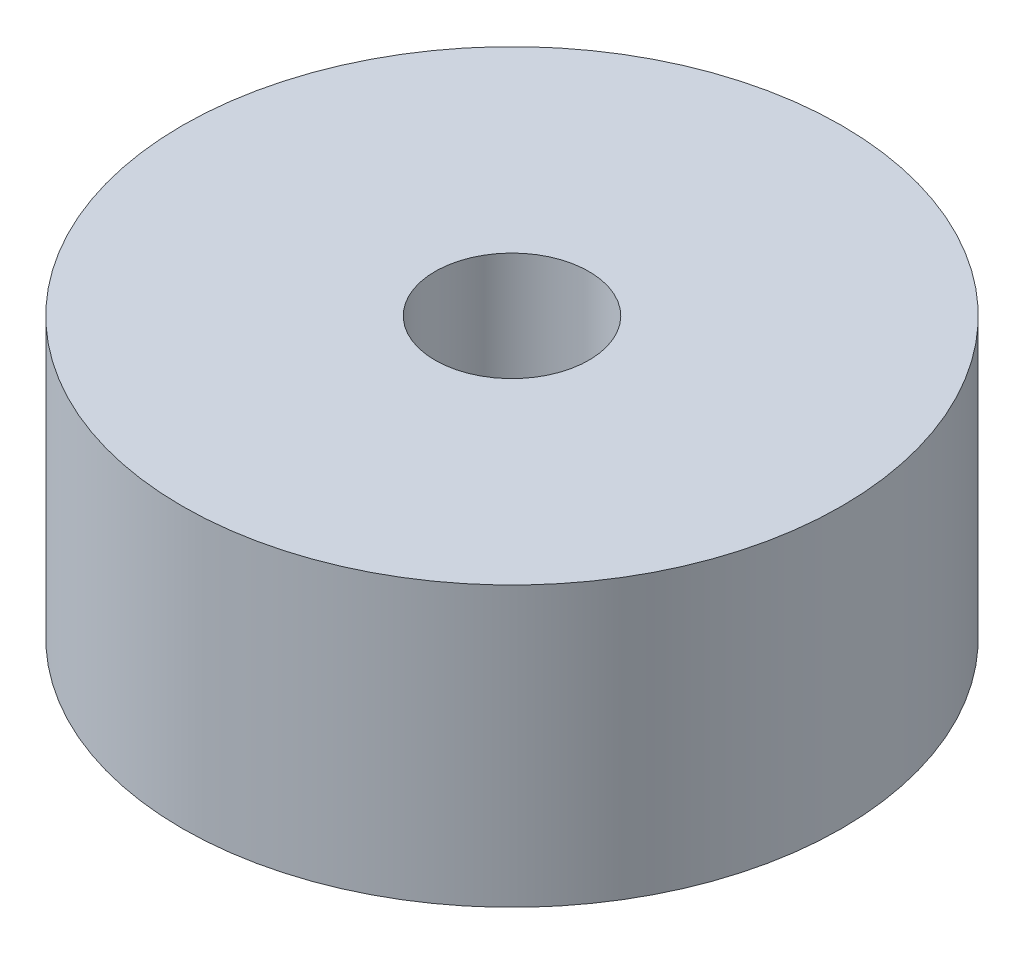
ISO-10303-21;
HEADER;
FILE_DESCRIPTION(('STEP AP214'),'2;1');
FILE_NAME('part.step','',(''),(''),'','','');
FILE_SCHEMA(('AUTOMOTIVE_DESIGN { 1 0 10303 214 1 1 1 1 }'));
ENDSEC;
DATA;
#1=APPLICATION_CONTEXT('core data for automotive mechanical design processes');
#2=APPLICATION_PROTOCOL_DEFINITION('international standard','automotive_design',2000,#1);
#3=PRODUCT_CONTEXT('',#1,'mechanical');
#4=PRODUCT('Part','Part','',(#3));
#5=PRODUCT_RELATED_PRODUCT_CATEGORY('part','',(#4));
#6=PRODUCT_DEFINITION_FORMATION('','',#4);
#7=PRODUCT_DEFINITION_CONTEXT('part definition',#1,'design');
#8=PRODUCT_DEFINITION('design','',#6,#7);
#9=PRODUCT_DEFINITION_SHAPE('','',#8);
#10=(LENGTH_UNIT() NAMED_UNIT(*) SI_UNIT(.MILLI.,.METRE.));
#11=(NAMED_UNIT(*) PLANE_ANGLE_UNIT() SI_UNIT($,.RADIAN.));
#12=(NAMED_UNIT(*) SI_UNIT($,.STERADIAN.) SOLID_ANGLE_UNIT());
#13=UNCERTAINTY_MEASURE_WITH_UNIT(LENGTH_MEASURE(1.E-05),#10,'distance_accuracy_value','');
#14=(GEOMETRIC_REPRESENTATION_CONTEXT(3) GLOBAL_UNCERTAINTY_ASSIGNED_CONTEXT((#13)) GLOBAL_UNIT_ASSIGNED_CONTEXT((#10,
#11,#12)) REPRESENTATION_CONTEXT('',''));
#15=CARTESIAN_POINT('',(0.,0.,0.));
#16=DIRECTION('',(0.,0.,1.));
#17=DIRECTION('',(1.,0.,0.));
#18=AXIS2_PLACEMENT_3D('',#15,#16,#17);
#19=CARTESIAN_POINT('',(0.,6.35,0.));
#20=DIRECTION('',(0.,-1.,0.));
#21=DIRECTION('',(0.,0.,-1.));
#22=AXIS2_PLACEMENT_3D('',#19,#20,#21);
#23=CYLINDRICAL_SURFACE('',#22,7.5);
#24=CARTESIAN_POINT('',(0.,6.35,0.));
#25=DIRECTION('',(0.,1.,0.));
#26=DIRECTION('',(0.,0.,1.));
#27=AXIS2_PLACEMENT_3D('',#24,#25,#26);
#28=CIRCLE('',#27,7.5);
#29=CARTESIAN_POINT('',(0.,6.35,7.5));
#30=VERTEX_POINT('',#29);
#31=EDGE_CURVE('E10',#30,#30,#28,.T.);
#32=ORIENTED_EDGE('',*,*,#31,.F.);
#33=EDGE_LOOP('',(#32));
#34=FACE_BOUND('',#33,.T.);
#35=CARTESIAN_POINT('',(0.,0.,0.));
#36=DIRECTION('',(0.,1.,0.));
#37=DIRECTION('',(0.,0.,1.));
#38=AXIS2_PLACEMENT_3D('',#35,#36,#37);
#39=CIRCLE('',#38,7.5);
#40=CARTESIAN_POINT('',(0.,0.,7.5));
#41=VERTEX_POINT('',#40);
#42=EDGE_CURVE('E35',#41,#41,#39,.T.);
#43=ORIENTED_EDGE('',*,*,#42,.T.);
#44=EDGE_LOOP('',(#43));
#45=FACE_BOUND('',#44,.T.);
#46=ADVANCED_FACE('F32',(#34,#45),#23,.T.);
#47=CARTESIAN_POINT('',(0.,6.35,0.));
#48=DIRECTION('',(0.,1.,0.));
#49=DIRECTION('',(0.,0.,1.));
#50=AXIS2_PLACEMENT_3D('',#47,#48,#49);
#51=PLANE('',#50);
#52=CARTESIAN_POINT('',(0.,6.35,0.));
#53=DIRECTION('',(0.,1.,0.));
#54=DIRECTION('',(0.,0.,1.));
#55=AXIS2_PLACEMENT_3D('',#52,#53,#54);
#56=CIRCLE('',#55,1.75);
#57=CARTESIAN_POINT('',(0.,6.35,1.75));
#58=VERTEX_POINT('',#57);
#59=EDGE_CURVE('E44',#58,#58,#56,.T.);
#60=ORIENTED_EDGE('',*,*,#59,.F.);
#61=EDGE_LOOP('',(#60));
#62=FACE_BOUND('',#61,.T.);
#63=ORIENTED_EDGE('',*,*,#31,.T.);
#64=EDGE_LOOP('',(#63));
#65=FACE_BOUND('',#64,.T.);
#66=ADVANCED_FACE('F59',(#62,#65),#51,.T.);
#67=CARTESIAN_POINT('',(0.,0.,0.));
#68=DIRECTION('',(0.,1.,0.));
#69=DIRECTION('',(0.,0.,1.));
#70=AXIS2_PLACEMENT_3D('',#67,#68,#69);
#71=PLANE('',#70);
#72=CARTESIAN_POINT('',(0.,0.,0.));
#73=DIRECTION('',(0.,1.,0.));
#74=DIRECTION('',(0.,0.,1.));
#75=AXIS2_PLACEMENT_3D('',#72,#73,#74);
#76=CIRCLE('',#75,1.75);
#77=CARTESIAN_POINT('',(0.,0.,1.75));
#78=VERTEX_POINT('',#77);
#79=EDGE_CURVE('E42',#78,#78,#76,.T.);
#80=ORIENTED_EDGE('',*,*,#79,.T.);
#81=EDGE_LOOP('',(#80));
#82=FACE_BOUND('',#81,.T.);
#83=ORIENTED_EDGE('',*,*,#42,.F.);
#84=EDGE_LOOP('',(#83));
#85=FACE_BOUND('',#84,.T.);
#86=ADVANCED_FACE('F50',(#82,#85),#71,.F.);
#87=CARTESIAN_POINT('',(0.,0.,0.));
#88=DIRECTION('',(0.,1.,0.));
#89=DIRECTION('',(0.,0.,1.));
#90=AXIS2_PLACEMENT_3D('',#87,#88,#89);
#91=CYLINDRICAL_SURFACE('',#90,1.75);
#92=ORIENTED_EDGE('',*,*,#79,.F.);
#93=EDGE_LOOP('',(#92));
#94=FACE_BOUND('',#93,.T.);
#95=ORIENTED_EDGE('',*,*,#59,.T.);
#96=EDGE_LOOP('',(#95));
#97=FACE_BOUND('',#96,.T.);
#98=ADVANCED_FACE('F53',(#94,#97),#91,.F.);
#99=CLOSED_SHELL('',(#46,#66,#86,#98));
#100=MANIFOLD_SOLID_BREP('B2',#99);
#101=ADVANCED_BREP_SHAPE_REPRESENTATION('',(#18,#100),#14);
#102=SHAPE_DEFINITION_REPRESENTATION(#9,#101);
ENDSEC;
END-ISO-10303-21;
